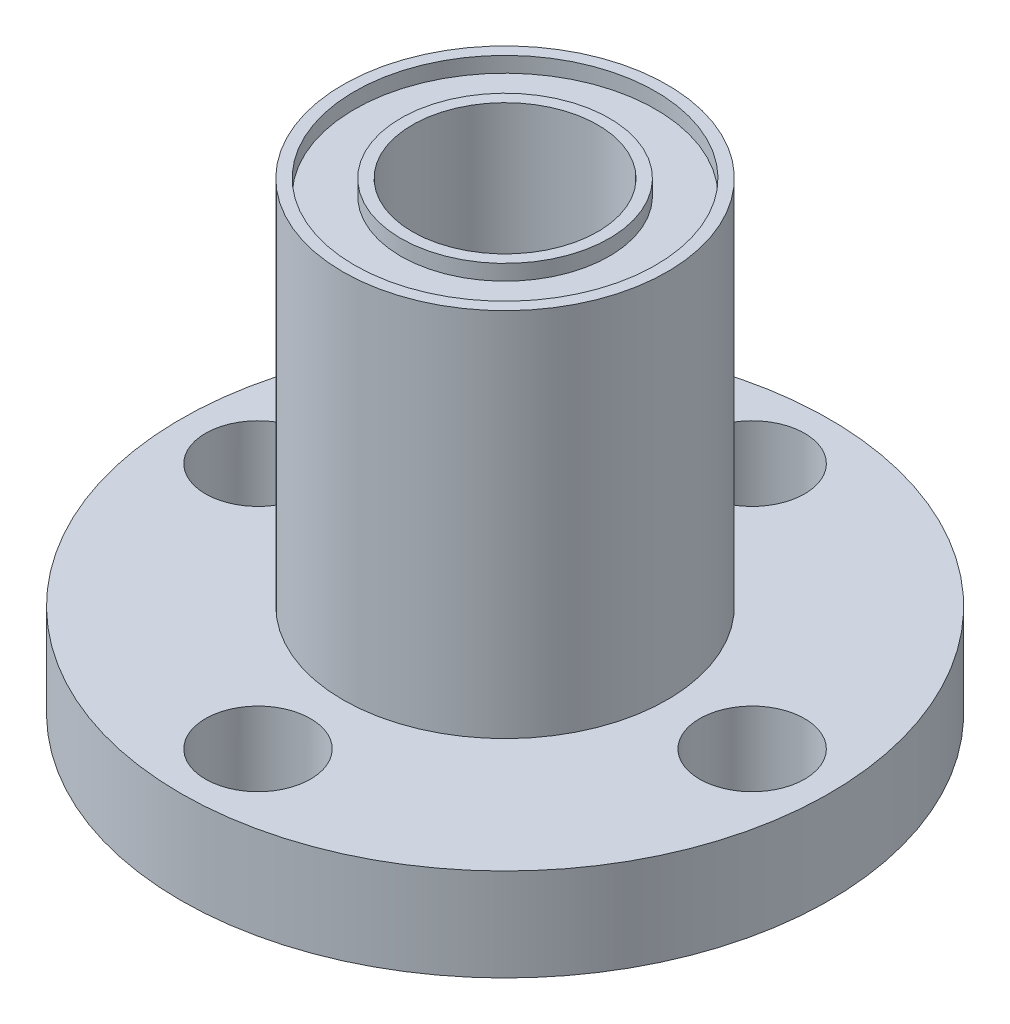
ISO-10303-21;
HEADER;
FILE_DESCRIPTION(('STEP AP214'),'2;1');
FILE_NAME('part.step','',(''),(''),'','','');
FILE_SCHEMA(('AUTOMOTIVE_DESIGN { 1 0 10303 214 1 1 1 1 }'));
ENDSEC;
DATA;
#1=APPLICATION_CONTEXT('core data for automotive mechanical design processes');
#2=APPLICATION_PROTOCOL_DEFINITION('international standard','automotive_design',2000,#1);
#3=PRODUCT_CONTEXT('',#1,'mechanical');
#4=PRODUCT('Part','Part','',(#3));
#5=PRODUCT_RELATED_PRODUCT_CATEGORY('part','',(#4));
#6=PRODUCT_DEFINITION_FORMATION('','',#4);
#7=PRODUCT_DEFINITION_CONTEXT('part definition',#1,'design');
#8=PRODUCT_DEFINITION('design','',#6,#7);
#9=PRODUCT_DEFINITION_SHAPE('','',#8);
#10=(LENGTH_UNIT() NAMED_UNIT(*) SI_UNIT(.MILLI.,.METRE.));
#11=(NAMED_UNIT(*) PLANE_ANGLE_UNIT() SI_UNIT($,.RADIAN.));
#12=(NAMED_UNIT(*) SI_UNIT($,.STERADIAN.) SOLID_ANGLE_UNIT());
#13=UNCERTAINTY_MEASURE_WITH_UNIT(LENGTH_MEASURE(1.E-05),#10,'distance_accuracy_value','');
#14=(GEOMETRIC_REPRESENTATION_CONTEXT(3) GLOBAL_UNCERTAINTY_ASSIGNED_CONTEXT((#13)) GLOBAL_UNIT_ASSIGNED_CONTEXT((#10,
#11,#12)) REPRESENTATION_CONTEXT('',''));
#15=CARTESIAN_POINT('',(0.,0.,0.));
#16=DIRECTION('',(0.,0.,1.));
#17=DIRECTION('',(1.,0.,0.));
#18=AXIS2_PLACEMENT_3D('',#15,#16,#17);
#19=CARTESIAN_POINT('',(0.,30.,0.));
#20=DIRECTION('',(0.,1.,0.));
#21=DIRECTION('',(0.,0.,1.));
#22=AXIS2_PLACEMENT_3D('',#19,#20,#21);
#23=PLANE('',#22);
#24=CARTESIAN_POINT('',(0.,30.,0.));
#25=DIRECTION('',(0.,1.,0.));
#26=DIRECTION('',(0.,0.,1.));
#27=AXIS2_PLACEMENT_3D('',#24,#25,#26);
#28=CIRCLE('',#27,6.);
#29=CARTESIAN_POINT('',(0.,30.,6.));
#30=VERTEX_POINT('',#29);
#31=EDGE_CURVE('E60',#30,#30,#28,.T.);
#32=ORIENTED_EDGE('',*,*,#31,.F.);
#33=EDGE_LOOP('',(#32));
#34=FACE_BOUND('',#33,.T.);
#35=CARTESIAN_POINT('',(0.,30.,0.));
#36=DIRECTION('',(0.,1.,0.));
#37=DIRECTION('',(0.,0.,1.));
#38=AXIS2_PLACEMENT_3D('',#35,#36,#37);
#39=CIRCLE('',#38,6.75);
#40=CARTESIAN_POINT('',(0.,30.,6.75));
#41=VERTEX_POINT('',#40);
#42=EDGE_CURVE('E76',#41,#41,#39,.T.);
#43=ORIENTED_EDGE('',*,*,#42,.T.);
#44=EDGE_LOOP('',(#43));
#45=FACE_BOUND('',#44,.T.);
#46=ADVANCED_FACE('F37',(#34,#45),#23,.T.);
#47=CARTESIAN_POINT('',(0.,6.,0.));
#48=DIRECTION('',(0.,1.,0.));
#49=DIRECTION('',(0.,0.,1.));
#50=AXIS2_PLACEMENT_3D('',#47,#48,#49);
#51=PLANE('',#50);
#52=CARTESIAN_POINT('',(0.,6.,16.));
#53=DIRECTION('',(0.,1.,0.));
#54=DIRECTION('',(0.,0.,1.));
#55=AXIS2_PLACEMENT_3D('',#52,#53,#54);
#56=CIRCLE('',#55,3.4);
#57=CARTESIAN_POINT('',(0.,6.,19.4));
#58=VERTEX_POINT('',#57);
#59=EDGE_CURVE('E91',#58,#58,#56,.T.);
#60=ORIENTED_EDGE('',*,*,#59,.F.);
#61=EDGE_LOOP('',(#60));
#62=FACE_BOUND('',#61,.T.);
#63=CARTESIAN_POINT('',(-16.,6.,0.));
#64=DIRECTION('',(0.,1.,0.));
#65=DIRECTION('',(0.,0.,1.));
#66=AXIS2_PLACEMENT_3D('',#63,#64,#65);
#67=CIRCLE('',#66,3.4);
#68=CARTESIAN_POINT('',(-16.,6.,3.4));
#69=VERTEX_POINT('',#68);
#70=EDGE_CURVE('E95',#69,#69,#67,.T.);
#71=ORIENTED_EDGE('',*,*,#70,.F.);
#72=EDGE_LOOP('',(#71));
#73=FACE_BOUND('',#72,.T.);
#74=CARTESIAN_POINT('',(1.6759110426447E-13,6.,-16.));
#75=DIRECTION('',(0.,1.,0.));
#76=DIRECTION('',(0.,0.,1.));
#77=AXIS2_PLACEMENT_3D('',#74,#75,#76);
#78=CIRCLE('',#77,3.4);
#79=CARTESIAN_POINT('',(1.6759110426447E-13,6.,-12.6));
#80=VERTEX_POINT('',#79);
#81=EDGE_CURVE('E99',#80,#80,#78,.T.);
#82=ORIENTED_EDGE('',*,*,#81,.F.);
#83=EDGE_LOOP('',(#82));
#84=FACE_BOUND('',#83,.T.);
#85=CARTESIAN_POINT('',(16.,6.,0.));
#86=DIRECTION('',(0.,1.,0.));
#87=DIRECTION('',(0.,0.,1.));
#88=AXIS2_PLACEMENT_3D('',#85,#86,#87);
#89=CIRCLE('',#88,3.4);
#90=CARTESIAN_POINT('',(16.,6.,3.4));
#91=VERTEX_POINT('',#90);
#92=EDGE_CURVE('E80',#91,#91,#89,.T.);
#93=ORIENTED_EDGE('',*,*,#92,.F.);
#94=EDGE_LOOP('',(#93));
#95=FACE_BOUND('',#94,.T.);
#96=CARTESIAN_POINT('',(0.,6.,0.));
#97=DIRECTION('',(0.,1.,0.));
#98=DIRECTION('',(0.,0.,1.));
#99=AXIS2_PLACEMENT_3D('',#96,#97,#98);
#100=CIRCLE('',#99,21.);
#101=CARTESIAN_POINT('',(0.,6.,21.));
#102=VERTEX_POINT('',#101);
#103=EDGE_CURVE('E10',#102,#102,#100,.T.);
#104=ORIENTED_EDGE('',*,*,#103,.T.);
#105=EDGE_LOOP('',(#104));
#106=FACE_BOUND('',#105,.T.);
#107=CARTESIAN_POINT('',(0.,6.,0.));
#108=DIRECTION('',(0.,1.,0.));
#109=DIRECTION('',(0.,0.,1.));
#110=AXIS2_PLACEMENT_3D('',#107,#108,#109);
#111=CIRCLE('',#110,10.5);
#112=CARTESIAN_POINT('',(0.,6.,10.5));
#113=VERTEX_POINT('',#112);
#114=EDGE_CURVE('E56',#113,#113,#111,.T.);
#115=ORIENTED_EDGE('',*,*,#114,.F.);
#116=EDGE_LOOP('',(#115));
#117=FACE_BOUND('',#116,.T.);
#118=ADVANCED_FACE('F131',(#62,#73,#84,#95,#106,#117),#51,.T.);
#119=CARTESIAN_POINT('',(0.,0.,0.));
#120=DIRECTION('',(0.,1.,0.));
#121=DIRECTION('',(0.,0.,1.));
#122=AXIS2_PLACEMENT_3D('',#119,#120,#121);
#123=PLANE('',#122);
#124=CARTESIAN_POINT('',(0.,0.,16.));
#125=DIRECTION('',(0.,1.,0.));
#126=DIRECTION('',(-1.,0.,0.));
#127=AXIS2_PLACEMENT_3D('',#124,#125,#126);
#128=CIRCLE('',#127,3.4);
#129=CARTESIAN_POINT('',(-3.40000000000005,0.,16.));
#130=VERTEX_POINT('',#129);
#131=EDGE_CURVE('E103',#130,#130,#128,.T.);
#132=ORIENTED_EDGE('',*,*,#131,.T.);
#133=EDGE_LOOP('',(#132));
#134=FACE_BOUND('',#133,.T.);
#135=CARTESIAN_POINT('',(-16.,0.,0.));
#136=DIRECTION('',(0.,1.,0.));
#137=DIRECTION('',(0.,0.,-1.));
#138=AXIS2_PLACEMENT_3D('',#135,#136,#137);
#139=CIRCLE('',#138,3.4);
#140=CARTESIAN_POINT('',(-16.,0.,-3.4));
#141=VERTEX_POINT('',#140);
#142=EDGE_CURVE('E108',#141,#141,#139,.T.);
#143=ORIENTED_EDGE('',*,*,#142,.T.);
#144=EDGE_LOOP('',(#143));
#145=FACE_BOUND('',#144,.T.);
#146=CARTESIAN_POINT('',(1.6759110426447E-13,0.,-16.));
#147=DIRECTION('',(0.,1.,0.));
#148=DIRECTION('',(1.,0.,0.));
#149=AXIS2_PLACEMENT_3D('',#146,#147,#148);
#150=CIRCLE('',#149,3.4);
#151=CARTESIAN_POINT('',(3.40000000000017,0.,-16.));
#152=VERTEX_POINT('',#151);
#153=EDGE_CURVE('E104',#152,#152,#150,.T.);
#154=ORIENTED_EDGE('',*,*,#153,.T.);
#155=EDGE_LOOP('',(#154));
#156=FACE_BOUND('',#155,.T.);
#157=CARTESIAN_POINT('',(16.,0.,0.));
#158=DIRECTION('',(0.,1.,0.));
#159=DIRECTION('',(0.,0.,1.));
#160=AXIS2_PLACEMENT_3D('',#157,#158,#159);
#161=CIRCLE('',#160,3.4);
#162=CARTESIAN_POINT('',(16.,0.,3.4));
#163=VERTEX_POINT('',#162);
#164=EDGE_CURVE('E87',#163,#163,#161,.T.);
#165=ORIENTED_EDGE('',*,*,#164,.T.);
#166=EDGE_LOOP('',(#165));
#167=FACE_BOUND('',#166,.T.);
#168=CARTESIAN_POINT('',(0.,0.,0.));
#169=DIRECTION('',(0.,1.,0.));
#170=DIRECTION('',(0.,0.,1.));
#171=AXIS2_PLACEMENT_3D('',#168,#169,#170);
#172=CIRCLE('',#171,21.);
#173=CARTESIAN_POINT('',(0.,0.,21.));
#174=VERTEX_POINT('',#173);
#175=EDGE_CURVE('E41',#174,#174,#172,.T.);
#176=ORIENTED_EDGE('',*,*,#175,.F.);
#177=EDGE_LOOP('',(#176));
#178=FACE_BOUND('',#177,.T.);
#179=CARTESIAN_POINT('',(0.,0.,0.));
#180=DIRECTION('',(0.,1.,0.));
#181=DIRECTION('',(0.,0.,1.));
#182=AXIS2_PLACEMENT_3D('',#179,#180,#181);
#183=CIRCLE('',#182,6.);
#184=CARTESIAN_POINT('',(0.,0.,6.));
#185=VERTEX_POINT('',#184);
#186=EDGE_CURVE('E50',#185,#185,#183,.T.);
#187=ORIENTED_EDGE('',*,*,#186,.T.);
#188=EDGE_LOOP('',(#187));
#189=FACE_BOUND('',#188,.T.);
#190=ADVANCED_FACE('F116',(#134,#145,#156,#167,#178,#189),#123,.F.);
#191=CARTESIAN_POINT('',(0.,6.,0.));
#192=DIRECTION('',(0.,-1.,0.));
#193=DIRECTION('',(0.,0.,-1.));
#194=AXIS2_PLACEMENT_3D('',#191,#192,#193);
#195=CYLINDRICAL_SURFACE('',#194,21.);
#196=ORIENTED_EDGE('',*,*,#103,.F.);
#197=EDGE_LOOP('',(#196));
#198=FACE_BOUND('',#197,.T.);
#199=ORIENTED_EDGE('',*,*,#175,.T.);
#200=EDGE_LOOP('',(#199));
#201=FACE_BOUND('',#200,.T.);
#202=ADVANCED_FACE('F39',(#198,#201),#195,.T.);
#203=CARTESIAN_POINT('',(0.,6.,0.));
#204=DIRECTION('',(0.,-1.,0.));
#205=DIRECTION('',(0.,0.,-1.));
#206=AXIS2_PLACEMENT_3D('',#203,#204,#205);
#207=CYLINDRICAL_SURFACE('',#206,6.);
#208=ORIENTED_EDGE('',*,*,#186,.F.);
#209=EDGE_LOOP('',(#208));
#210=FACE_BOUND('',#209,.T.);
#211=ORIENTED_EDGE('',*,*,#31,.T.);
#212=EDGE_LOOP('',(#211));
#213=FACE_BOUND('',#212,.T.);
#214=ADVANCED_FACE('F146',(#210,#213),#207,.F.);
#215=CARTESIAN_POINT('',(0.,30.,0.));
#216=DIRECTION('',(0.,1.,0.));
#217=DIRECTION('',(0.,0.,1.));
#218=AXIS2_PLACEMENT_3D('',#215,#216,#217);
#219=CIRCLE('',#218,9.75);
#220=CARTESIAN_POINT('',(0.,30.,9.75));
#221=VERTEX_POINT('',#220);
#222=EDGE_CURVE('E68',#221,#221,#219,.T.);
#223=ORIENTED_EDGE('',*,*,#222,.F.);
#224=EDGE_LOOP('',(#223));
#225=FACE_BOUND('',#224,.T.);
#226=CARTESIAN_POINT('',(0.,30.,0.));
#227=DIRECTION('',(0.,1.,0.));
#228=DIRECTION('',(0.,0.,1.));
#229=AXIS2_PLACEMENT_3D('',#226,#227,#228);
#230=CIRCLE('',#229,10.5);
#231=CARTESIAN_POINT('',(0.,30.,10.5));
#232=VERTEX_POINT('',#231);
#233=EDGE_CURVE('E55',#232,#232,#230,.T.);
#234=ORIENTED_EDGE('',*,*,#233,.T.);
#235=EDGE_LOOP('',(#234));
#236=FACE_BOUND('',#235,.T.);
#237=ADVANCED_FACE('F134',(#225,#236),#23,.T.);
#238=CARTESIAN_POINT('',(0.,30.,0.));
#239=DIRECTION('',(0.,-1.,0.));
#240=DIRECTION('',(0.,0.,-1.));
#241=AXIS2_PLACEMENT_3D('',#238,#239,#240);
#242=CYLINDRICAL_SURFACE('',#241,10.5);
#243=ORIENTED_EDGE('',*,*,#233,.F.);
#244=EDGE_LOOP('',(#243));
#245=FACE_BOUND('',#244,.T.);
#246=ORIENTED_EDGE('',*,*,#114,.T.);
#247=EDGE_LOOP('',(#246));
#248=FACE_BOUND('',#247,.T.);
#249=ADVANCED_FACE('F145',(#245,#248),#242,.T.);
#250=CARTESIAN_POINT('',(0.,29.,0.));
#251=DIRECTION('',(0.,1.,0.));
#252=DIRECTION('',(0.,0.,1.));
#253=AXIS2_PLACEMENT_3D('',#250,#251,#252);
#254=CYLINDRICAL_SURFACE('',#253,9.75);
#255=CARTESIAN_POINT('',(0.,29.,0.));
#256=DIRECTION('',(0.,1.,0.));
#257=DIRECTION('',(0.,0.,1.));
#258=AXIS2_PLACEMENT_3D('',#255,#256,#257);
#259=CIRCLE('',#258,9.75);
#260=CARTESIAN_POINT('',(0.,29.,9.75));
#261=VERTEX_POINT('',#260);
#262=EDGE_CURVE('E67',#261,#261,#259,.T.);
#263=ORIENTED_EDGE('',*,*,#262,.F.);
#264=EDGE_LOOP('',(#263));
#265=FACE_BOUND('',#264,.T.);
#266=ORIENTED_EDGE('',*,*,#222,.T.);
#267=EDGE_LOOP('',(#266));
#268=FACE_BOUND('',#267,.T.);
#269=ADVANCED_FACE('F152',(#265,#268),#254,.F.);
#270=CARTESIAN_POINT('',(0.,29.,0.));
#271=DIRECTION('',(0.,1.,0.));
#272=DIRECTION('',(0.,0.,1.));
#273=AXIS2_PLACEMENT_3D('',#270,#271,#272);
#274=PLANE('',#273);
#275=CARTESIAN_POINT('',(0.,29.,0.));
#276=DIRECTION('',(0.,1.,0.));
#277=DIRECTION('',(0.,0.,1.));
#278=AXIS2_PLACEMENT_3D('',#275,#276,#277);
#279=CIRCLE('',#278,6.75);
#280=CARTESIAN_POINT('',(0.,29.,6.75));
#281=VERTEX_POINT('',#280);
#282=EDGE_CURVE('E72',#281,#281,#279,.T.);
#283=ORIENTED_EDGE('',*,*,#282,.F.);
#284=EDGE_LOOP('',(#283));
#285=FACE_BOUND('',#284,.T.);
#286=ORIENTED_EDGE('',*,*,#262,.T.);
#287=EDGE_LOOP('',(#286));
#288=FACE_BOUND('',#287,.T.);
#289=ADVANCED_FACE('F164',(#285,#288),#274,.T.);
#290=CARTESIAN_POINT('',(0.,29.,0.));
#291=DIRECTION('',(0.,1.,0.));
#292=DIRECTION('',(0.,0.,1.));
#293=AXIS2_PLACEMENT_3D('',#290,#291,#292);
#294=CYLINDRICAL_SURFACE('',#293,6.75);
#295=ORIENTED_EDGE('',*,*,#282,.T.);
#296=EDGE_LOOP('',(#295));
#297=FACE_BOUND('',#296,.T.);
#298=ORIENTED_EDGE('',*,*,#42,.F.);
#299=EDGE_LOOP('',(#298));
#300=FACE_BOUND('',#299,.T.);
#301=ADVANCED_FACE('F169',(#297,#300),#294,.T.);
#302=CARTESIAN_POINT('',(16.,0.,0.));
#303=DIRECTION('',(0.,1.,0.));
#304=DIRECTION('',(0.,0.,1.));
#305=AXIS2_PLACEMENT_3D('',#302,#303,#304);
#306=CYLINDRICAL_SURFACE('',#305,3.4);
#307=ORIENTED_EDGE('',*,*,#92,.T.);
#308=EDGE_LOOP('',(#307));
#309=FACE_BOUND('',#308,.T.);
#310=ORIENTED_EDGE('',*,*,#164,.F.);
#311=EDGE_LOOP('',(#310));
#312=FACE_BOUND('',#311,.T.);
#313=ADVANCED_FACE('F176',(#309,#312),#306,.F.);
#314=CARTESIAN_POINT('',(1.6759110426447E-13,0.,-16.));
#315=DIRECTION('',(0.,1.,0.));
#316=DIRECTION('',(0.,0.,1.));
#317=AXIS2_PLACEMENT_3D('',#314,#315,#316);
#318=CYLINDRICAL_SURFACE('',#317,3.4);
#319=ORIENTED_EDGE('',*,*,#81,.T.);
#320=EDGE_LOOP('',(#319));
#321=FACE_BOUND('',#320,.T.);
#322=ORIENTED_EDGE('',*,*,#153,.F.);
#323=EDGE_LOOP('',(#322));
#324=FACE_BOUND('',#323,.T.);
#325=ADVANCED_FACE('F127',(#321,#324),#318,.F.);
#326=CARTESIAN_POINT('',(-16.,0.,0.));
#327=DIRECTION('',(0.,1.,0.));
#328=DIRECTION('',(0.,0.,1.));
#329=AXIS2_PLACEMENT_3D('',#326,#327,#328);
#330=CYLINDRICAL_SURFACE('',#329,3.4);
#331=ORIENTED_EDGE('',*,*,#70,.T.);
#332=EDGE_LOOP('',(#331));
#333=FACE_BOUND('',#332,.T.);
#334=ORIENTED_EDGE('',*,*,#142,.F.);
#335=EDGE_LOOP('',(#334));
#336=FACE_BOUND('',#335,.T.);
#337=ADVANCED_FACE('F121',(#333,#336),#330,.F.);
#338=CARTESIAN_POINT('',(0.,0.,16.));
#339=DIRECTION('',(0.,1.,0.));
#340=DIRECTION('',(0.,0.,1.));
#341=AXIS2_PLACEMENT_3D('',#338,#339,#340);
#342=CYLINDRICAL_SURFACE('',#341,3.4);
#343=ORIENTED_EDGE('',*,*,#59,.T.);
#344=EDGE_LOOP('',(#343));
#345=FACE_BOUND('',#344,.T.);
#346=ORIENTED_EDGE('',*,*,#131,.F.);
#347=EDGE_LOOP('',(#346));
#348=FACE_BOUND('',#347,.T.);
#349=ADVANCED_FACE('F119',(#345,#348),#342,.F.);
#350=CLOSED_SHELL('',(#46,#118,#190,#202,#214,#237,#249,#269,#289,#301,#313,#325,#337,#349));
#351=MANIFOLD_SOLID_BREP('B2',#350);
#352=ADVANCED_BREP_SHAPE_REPRESENTATION('',(#18,#351),#14);
#353=SHAPE_DEFINITION_REPRESENTATION(#9,#352);
ENDSEC;
END-ISO-10303-21;
